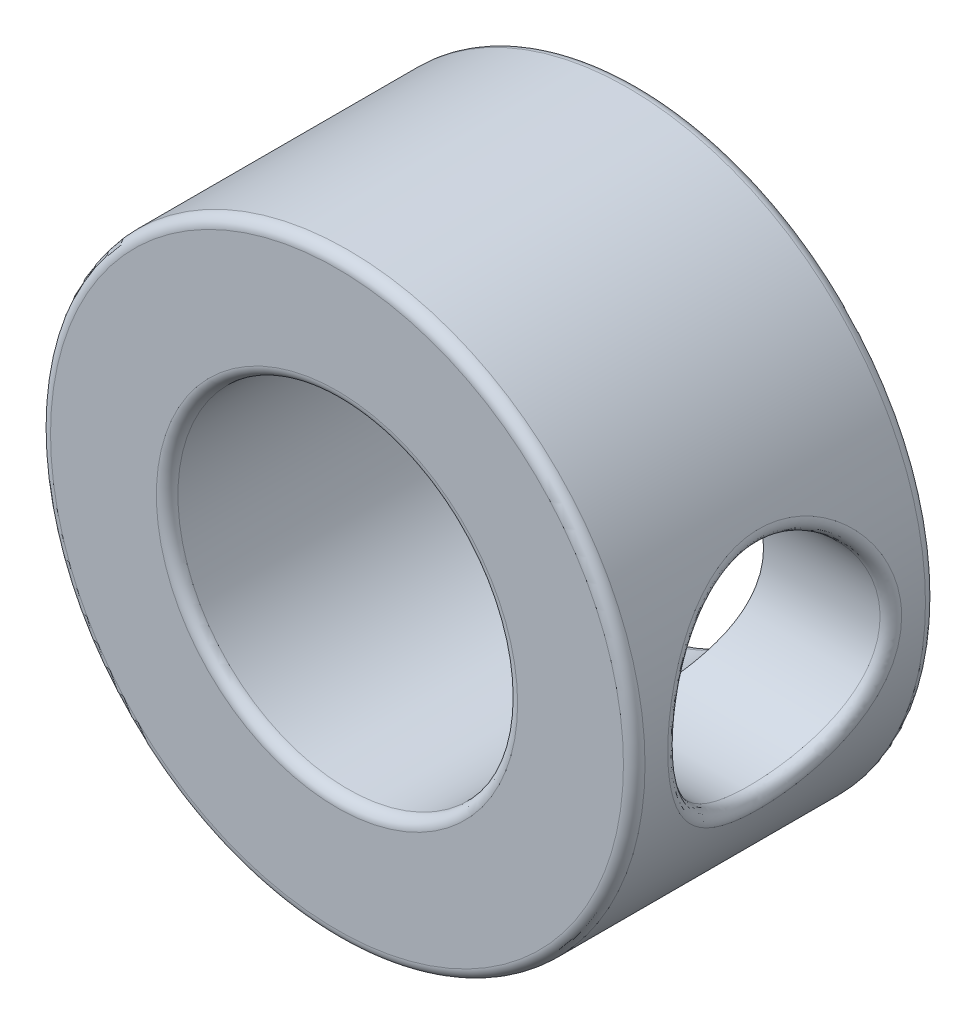
ISO-10303-21;
HEADER;
FILE_DESCRIPTION(('STEP AP214'),'2;1');
FILE_NAME('part.step','',(''),(''),'','','');
FILE_SCHEMA(('AUTOMOTIVE_DESIGN { 1 0 10303 214 1 1 1 1 }'));
ENDSEC;
DATA;
#1=APPLICATION_CONTEXT('core data for automotive mechanical design processes');
#2=APPLICATION_PROTOCOL_DEFINITION('international standard','automotive_design',2000,#1);
#3=PRODUCT_CONTEXT('',#1,'mechanical');
#4=PRODUCT('Part','Part','',(#3));
#5=PRODUCT_RELATED_PRODUCT_CATEGORY('part','',(#4));
#6=PRODUCT_DEFINITION_FORMATION('','',#4);
#7=PRODUCT_DEFINITION_CONTEXT('part definition',#1,'design');
#8=PRODUCT_DEFINITION('design','',#6,#7);
#9=PRODUCT_DEFINITION_SHAPE('','',#8);
#10=(LENGTH_UNIT() NAMED_UNIT(*) SI_UNIT(.MILLI.,.METRE.));
#11=(NAMED_UNIT(*) PLANE_ANGLE_UNIT() SI_UNIT($,.RADIAN.));
#12=(NAMED_UNIT(*) SI_UNIT($,.STERADIAN.) SOLID_ANGLE_UNIT());
#13=UNCERTAINTY_MEASURE_WITH_UNIT(LENGTH_MEASURE(1.E-05),#10,'distance_accuracy_value','');
#14=(GEOMETRIC_REPRESENTATION_CONTEXT(3) GLOBAL_UNCERTAINTY_ASSIGNED_CONTEXT((#13)) GLOBAL_UNIT_ASSIGNED_CONTEXT((#10,
#11,#12)) REPRESENTATION_CONTEXT('',''));
#15=CARTESIAN_POINT('',(0.,0.,0.));
#16=DIRECTION('',(0.,0.,1.));
#17=DIRECTION('',(1.,0.,0.));
#18=AXIS2_PLACEMENT_3D('',#15,#16,#17);
#19=CARTESIAN_POINT('',(0.,0.,7.112));
#20=DIRECTION('',(0.,0.,-1.));
#21=DIRECTION('',(-1.,0.,0.));
#22=AXIS2_PLACEMENT_3D('',#19,#20,#21);
#23=CYLINDRICAL_SURFACE('',#22,7.);
#24=CARTESIAN_POINT('',(0.,0.,0.254));
#25=DIRECTION('',(0.,0.,1.));
#26=DIRECTION('',(1.,0.,0.));
#27=AXIS2_PLACEMENT_3D('',#24,#25,#26);
#28=CIRCLE('',#27,7.);
#29=CARTESIAN_POINT('',(7.,0.,0.254));
#30=VERTEX_POINT('',#29);
#31=EDGE_CURVE('E56',#30,#30,#28,.T.);
#32=ORIENTED_EDGE('',*,*,#31,.T.);
#33=EDGE_LOOP('',(#32));
#34=FACE_BOUND('',#33,.T.);
#35=CARTESIAN_POINT('',(6.74599500718926,-0.00745052215797418,6.06868889791926));
#36=CARTESIAN_POINT('',(6.99999574017128,-0.00775954866647524,6.06868797695163));
#37=CARTESIAN_POINT('',(6.99999481920024,-0.00851652334191676,6.32268776994786));
#38=CARTESIAN_POINT('',(6.74617475965916,0.124835560306429,6.069086080199));
#39=CARTESIAN_POINT('',(7.00015029724777,0.129996556773914,6.06912106931478));
#40=CARTESIAN_POINT('',(7.00018133971602,0.142696705103797,6.32312530594202));
#41=CARTESIAN_POINT('',(6.74158726574779,0.257138681927097,6.05894237310063));
#42=CARTESIAN_POINT('',(6.99620204408758,0.26826355056612,6.05805022996153));
#43=CARTESIAN_POINT('',(6.99542111770413,0.293929410623252,6.31195099821696));
#44=CARTESIAN_POINT('',(6.7233669678945,0.517967373589116,6.01801333593985));
#45=CARTESIAN_POINT('',(6.98070531949423,0.539434271171296,6.01378552701942));
#46=CARTESIAN_POINT('',(6.97651479025564,0.592076787908436,6.2668635708834));
#47=CARTESIAN_POINT('',(6.70973425810543,0.646492982936553,5.98722822073657));
#48=CARTESIAN_POINT('',(6.96905385022817,0.673211427196951,5.98029468301626));
#49=CARTESIAN_POINT('',(6.96236878251692,0.738991504604062,6.23295068796371));
#50=CARTESIAN_POINT('',(6.67488718386159,0.895641381954533,5.90641209807691));
#51=CARTESIAN_POINT('',(6.93969470419769,0.930822766268684,5.89325263934802));
#52=CARTESIAN_POINT('',(6.92620964822275,1.02378740357091,6.14392364724122));
#53=CARTESIAN_POINT('',(6.6537131560639,1.01630225225893,5.85648337834778));
#54=CARTESIAN_POINT('',(6.92185086834899,1.05535653793761,5.83928123973794));
#55=CARTESIAN_POINT('',(6.90423837707852,1.16171211495338,6.08892216959862));
#56=CARTESIAN_POINT('',(6.60577141401848,1.24769505750066,5.7389785534838));
#57=CARTESIAN_POINT('',(6.8821123944386,1.29232382007279,5.713633277951));
#58=CARTESIAN_POINT('',(6.85449153548767,1.42621199637491,5.95947885452916));
#59=CARTESIAN_POINT('',(6.57900217147332,1.35842426783403,5.6713976254984));
#60=CARTESIAN_POINT('',(6.86004484818301,1.40508746039763,5.6413153254743));
#61=CARTESIAN_POINT('',(6.82671437920034,1.55278405198084,5.88503170425012));
#62=CARTESIAN_POINT('',(6.52052151386465,1.57419410821126,5.51567068467706));
#63=CARTESIAN_POINT('',(6.81271802853817,1.62297606677249,5.476552103599));
#64=CARTESIAN_POINT('',(6.76603181072791,1.79942567546163,5.71348290623909));
#65=CARTESIAN_POINT('',(6.48860661428057,1.6784567525599,5.42650963693316));
#66=CARTESIAN_POINT('',(6.78724794589171,1.72702348546625,5.38254612816564));
#67=CARTESIAN_POINT('',(6.73291525237285,1.91860594546923,5.61526309605367));
#68=CARTESIAN_POINT('',(6.42438105147322,1.87100880090019,5.23243750721342));
#69=CARTESIAN_POINT('',(6.73717148199862,1.91705862237536,5.18089226940311));
#70=CARTESIAN_POINT('',(6.66627147241469,2.13870783624837,5.4014732379559));
#71=CARTESIAN_POINT('',(6.3920703140393,1.9592951592129,5.12752342908013));
#72=CARTESIAN_POINT('',(6.71256140693235,2.00262984024887,5.07273090275755));
#73=CARTESIAN_POINT('',(6.63274417380709,2.2396259755733,5.2858998894765));
#74=CARTESIAN_POINT('',(6.32889383780691,2.12175246984529,4.89866432164761));
#75=CARTESIAN_POINT('',(6.66560179013371,2.15834311294188,4.84036130261562));
#76=CARTESIAN_POINT('',(6.5671889811011,2.42532725259425,5.03378869672509));
#77=CARTESIAN_POINT('',(6.29817738047511,2.19501535861611,4.77403697608756));
#78=CARTESIAN_POINT('',(6.6436241820243,2.22658491299537,4.71570407447646));
#79=CARTESIAN_POINT('',(6.53531598914885,2.50907240337135,4.89649921286074));
#80=CARTESIAN_POINT('',(6.2438892298088,2.31931829921106,4.51296569556758));
#81=CARTESIAN_POINT('',(6.60569009337165,2.34119243601201,4.45884049347737));
#82=CARTESIAN_POINT('',(6.47898378401825,2.65116028288201,4.60890309024146));
#83=CARTESIAN_POINT('',(6.22031435749867,2.37036824324256,4.37652705311809));
#84=CARTESIAN_POINT('',(6.59002470400532,2.38657655555385,4.32726570160749));
#85=CARTESIAN_POINT('',(6.45452127216944,2.70951431917396,4.45860228171603));
#86=CARTESIAN_POINT('',(6.18443493529895,2.44648664924731,4.10174894600231));
#87=CARTESIAN_POINT('',(6.56646971684204,2.45406174138135,4.06538176126362));
#88=CARTESIAN_POINT('',(6.41729092017634,2.79652354725973,4.15590671891505));
#89=CARTESIAN_POINT('',(6.17169113025569,2.47257376857739,3.96374087413946));
#90=CARTESIAN_POINT('',(6.55851674389204,2.47636832404332,3.9363969955974));
#91=CARTESIAN_POINT('',(6.40406728607884,2.82634314323857,4.0038770269516));
#92=CARTESIAN_POINT('',(6.15766919079355,2.5012249014656,3.6848604724077));
#93=CARTESIAN_POINT('',(6.5496757407383,2.50114510337192,3.67598562081094));
#94=CARTESIAN_POINT('',(6.38951739333781,2.85909360512128,3.69666237640475));
#95=CARTESIAN_POINT('',(6.1563846674149,2.50380202270742,3.54398978246969));
#96=CARTESIAN_POINT('',(6.54889557520336,2.50331274178223,3.54620429092653));
#97=CARTESIAN_POINT('',(6.38818450517773,2.86203945412186,3.54147922436922));
#98=CARTESIAN_POINT('',(6.16510701715563,2.48603940149925,3.27467873157116));
#99=CARTESIAN_POINT('',(6.55437545682559,2.4879827951206,3.29526601767755));
#100=CARTESIAN_POINT('',(6.39723526831701,2.84173540362241,3.24480617069823));
#101=CARTESIAN_POINT('',(6.17427435775616,2.46740373106779,3.14609841771757));
#102=CARTESIAN_POINT('',(6.56005214291856,2.47211489630638,3.17562681110344));
#103=CARTESIAN_POINT('',(6.40674777707107,2.82043339030019,3.10316209695588));
#104=CARTESIAN_POINT('',(6.20138388661499,2.41072452564713,2.8940938933087));
#105=CARTESIAN_POINT('',(6.57758779358048,2.42231648838049,2.93717425331876));
#106=CARTESIAN_POINT('',(6.4348780323861,2.7556446727268,2.82555391287066));
#107=CARTESIAN_POINT('',(6.21932756401245,2.37267769699095,2.7706705616317));
#108=CARTESIAN_POINT('',(6.58927755524305,2.38887375002368,2.81944325121164));
#109=CARTESIAN_POINT('',(6.45349732415524,2.71215420355941,2.6895907707001));
#110=CARTESIAN_POINT('',(6.26222721557043,2.27780631864489,2.53015585140741));
#111=CARTESIAN_POINT('',(6.61849346437203,2.30280266485545,2.58586321498023));
#112=CARTESIAN_POINT('',(6.49801223070246,2.60370887698734,2.42463976590368));
#113=CARTESIAN_POINT('',(6.28728604764049,2.22070400242742,2.41318988469384));
#114=CARTESIAN_POINT('',(6.63589033998288,2.2505692345565,2.47070455336523));
#115=CARTESIAN_POINT('',(6.52401457618485,2.5384365109469,2.29579005695349));
#116=CARTESIAN_POINT('',(6.3416584943086,2.08942097198359,2.18988124504264));
#117=CARTESIAN_POINT('',(6.67510159084638,2.12712238612379,2.24745346481761));
#118=CARTESIAN_POINT('',(6.58043425106791,2.38836984857238,2.04979325952076));
#119=CARTESIAN_POINT('',(6.37098094615926,2.01520459333029,2.08356143091079));
#120=CARTESIAN_POINT('',(6.69674839069637,2.05655739596535,2.13954752885772));
#121=CARTESIAN_POINT('',(6.61086075046211,2.30353478503895,1.93267135229876));
#122=CARTESIAN_POINT('',(6.43343248507526,1.84480777933649,1.87572390122297));
#123=CARTESIAN_POINT('',(6.74411824857742,1.89129221498729,1.92659635916525));
#124=CARTESIAN_POINT('',(6.67566371124585,2.10875804154355,1.70371752957919));
#125=CARTESIAN_POINT('',(6.46667759999969,1.74733598177556,1.77529096529201));
#126=CARTESIAN_POINT('',(6.76999902360233,1.79552742443319,1.82194126110804));
#127=CARTESIAN_POINT('',(6.71016056913222,1.99734023463259,1.59308060731098));
#128=CARTESIAN_POINT('',(6.53119380168288,1.5369123966416,1.59200125948189));
#129=CARTESIAN_POINT('',(6.82119569283943,1.58560318589575,1.62987378884546));
#130=CARTESIAN_POINT('',(6.77710593103787,1.75680979440163,1.39116866739033));
#131=CARTESIAN_POINT('',(6.56246818627252,1.42398753028151,1.50911454779781));
#132=CARTESIAN_POINT('',(6.84658402540374,1.47173299218538,1.54176154519891));
#133=CARTESIAN_POINT('',(6.80955785705728,1.62772793411116,1.29986066584544));
#134=CARTESIAN_POINT('',(6.62061378231264,1.18187120582218,1.36102484885744));
#135=CARTESIAN_POINT('',(6.89421869795565,1.22552774355322,1.38427660666702));
#136=CARTESIAN_POINT('',(6.86989274776059,1.3509702404875,1.13672505351021));
#137=CARTESIAN_POINT('',(6.64734657230553,1.05232836656872,1.29634786762083));
#138=CARTESIAN_POINT('',(6.91658186261675,1.09248736959098,1.31454210362623));
#139=CARTESIAN_POINT('',(6.89763207914547,1.20289275130575,1.06547689094913));
#140=CARTESIAN_POINT('',(6.69231708566452,0.78294869085631,1.1900567413545));
#141=CARTESIAN_POINT('',(6.95425779013848,0.814861539100033,1.20034168784231));
#142=CARTESIAN_POINT('',(6.94429581963911,0.894970937587026,0.948386586245924));
#143=CARTESIAN_POINT('',(6.71055665821608,0.643114102853319,1.14843757568783));
#144=CARTESIAN_POINT('',(6.96981502511989,0.669556426716317,1.15506834092958));
#145=CARTESIAN_POINT('',(6.96322214755874,0.735129183209213,0.902538913370125));
#146=CARTESIAN_POINT('',(6.73680606806903,0.352345868297734,1.08905573446135));
#147=CARTESIAN_POINT('',(6.99208697329174,0.367666693145553,1.09092310610918));
#148=CARTESIAN_POINT('',(6.99045989869069,0.402758591700327,0.837123877090485));
#149=CARTESIAN_POINT('',(6.74442405090057,0.201193886132936,1.07220570423221));
#150=CARTESIAN_POINT('',(6.99865558212128,0.209596007369462,1.07249670636575));
#151=CARTESIAN_POINT('',(6.99836471334925,0.229980180070058,0.81856188378181));
#152=CARTESIAN_POINT('',(6.7471311492059,-0.101743128314702,1.06618343862989));
#153=CARTESIAN_POINT('',(7.00096379231302,-0.105866177890564,1.06597768407563));
#154=CARTESIAN_POINT('',(7.00117373916869,-0.116300268464983,0.811927755992532));
#155=CARTESIAN_POINT('',(6.74222234658202,-0.253528051219516,1.0770066040813));
#156=CARTESIAN_POINT('',(6.99672634589457,-0.264692295457886,1.07782052618199));
#157=CARTESIAN_POINT('',(6.99608011061958,-0.289802180342207,0.823850555060279));
#158=CARTESIAN_POINT('',(6.72149200392215,-0.53922249566664,1.12362265272209));
#159=CARTESIAN_POINT('',(6.97911064771732,-0.561575132057807,1.12820055613337));
#160=CARTESIAN_POINT('',(6.97456923025548,-0.616373037142319,0.875202794234697));
#161=CARTESIAN_POINT('',(6.70663076400289,-0.673556627158349,1.15722118557895));
#162=CARTESIAN_POINT('',(6.96640519535537,-0.701387976153548,1.16477221645581));
#163=CARTESIAN_POINT('',(6.9591484357296,-0.76992734409442,0.912214938016811));
#164=CARTESIAN_POINT('',(6.66864848829413,-0.933983964250526,1.24564470355815));
#165=CARTESIAN_POINT('',(6.93443904336934,-0.970491739416666,1.25996635860784));
#166=CARTESIAN_POINT('',(6.91973605371112,-1.0676159420748,1.00962228542852));
#167=CARTESIAN_POINT('',(6.64552756344272,-1.06007728050873,1.30046940358686));
#168=CARTESIAN_POINT('',(6.91497959072871,-1.10050364819274,1.31921737695957));
#169=CARTESIAN_POINT('',(6.89574458133365,-1.21175035959344,1.07001717499898));
#170=CARTESIAN_POINT('',(6.59350313896387,-1.30049787456635,1.42924582951773));
#171=CARTESIAN_POINT('',(6.8719867473983,-1.34628102718631,1.45672813385501));
#172=CARTESIAN_POINT('',(6.84176133578025,-1.48656970204544,1.21187728578905));
#173=CARTESIAN_POINT('',(6.56461537128212,-1.41485590844356,1.50314567572079));
#174=CARTESIAN_POINT('',(6.84826886049391,-1.46242406439471,1.53568582522136));
#175=CARTESIAN_POINT('',(6.81178588689061,-1.6172897835561,1.29328535633229));
#176=CARTESIAN_POINT('',(6.50386917324341,-1.62973329234693,1.66808783703664));
#177=CARTESIAN_POINT('',(6.79942101374447,-1.6785170052823,1.70961253538459));
#178=CARTESIAN_POINT('',(6.74875247654279,-1.86291126039933,1.47498564123637));
#179=CARTESIAN_POINT('',(6.4720098205443,-1.7302483215453,1.75913548360581));
#180=CARTESIAN_POINT('',(6.77417751903423,-1.77838180339077,1.80527329684683));
#181=CARTESIAN_POINT('',(6.7156935580149,-1.9778077166915,1.57528372872957));
#182=CARTESIAN_POINT('',(6.40692714327061,-1.91974259715151,1.96101300280086));
#183=CARTESIAN_POINT('',(6.72377491772203,-1.96467323656207,2.01442375905859));
#184=CARTESIAN_POINT('',(6.64816039199597,-2.19441433671334,1.79767200389653));
#185=CARTESIAN_POINT('',(6.37371152519006,-2.00793938026583,2.07258116524781));
#186=CARTESIAN_POINT('',(6.6987367491815,-2.04958140693839,2.12889553933528));
#187=CARTESIAN_POINT('',(6.61369414111891,-2.29523008434207,1.92057549163502));
#188=CARTESIAN_POINT('',(6.31121658717996,-2.16451428897615,2.30970896802177));
#189=CARTESIAN_POINT('',(6.65283299890492,-2.19851011844833,2.36814805169349));
#190=CARTESIAN_POINT('',(6.54884614719724,-2.47420732060731,2.1817954791641));
#191=CARTESIAN_POINT('',(6.28193735665949,-2.23289196445184,2.43526892603284));
#192=CARTESIAN_POINT('',(6.63216244418459,-2.26167206869169,2.49289730402178));
#193=CARTESIAN_POINT('',(6.51846449692815,-2.55236829472148,2.32011232891544));
#194=CARTESIAN_POINT('',(6.23103619756914,-2.34748784712025,2.69710716043137));
#195=CARTESIAN_POINT('',(6.59701541304028,-2.36654554498145,2.74897710174495));
#196=CARTESIAN_POINT('',(6.46564681045398,-2.68336025597442,2.60855332793352));
#197=CARTESIAN_POINT('',(6.20940070286188,-2.39374536539925,2.83336591765194));
#198=CARTESIAN_POINT('',(6.5828180663572,-2.40735043507475,2.87955884061482));
#199=CARTESIAN_POINT('',(6.44319669732043,-2.73623617872677,2.75865597488601));
#200=CARTESIAN_POINT('',(6.1768066694294,-2.46226954609273,3.11276617212144));
#201=CARTESIAN_POINT('',(6.56160267223961,-2.46779103397403,3.14470547543043));
#202=CARTESIAN_POINT('',(6.40937543520834,-2.81456461959772,3.06644329520835));
#203=CARTESIAN_POINT('',(6.16583982164306,-2.48455488019382,3.25590222180086));
#204=CARTESIAN_POINT('',(6.55482817048821,-2.48672064125955,3.27783148129184));
#205=CARTESIAN_POINT('',(6.39799566431638,-2.84003848089893,3.22412196753563));
#206=CARTESIAN_POINT('',(6.15663635534922,-2.50328258444837,3.5327779031588));
#207=CARTESIAN_POINT('',(6.54905896639293,-2.50285159529922,3.535753004738));
#208=CARTESIAN_POINT('',(6.38844566965103,-2.86144569599824,3.52912821811991));
#209=CARTESIAN_POINT('',(6.15746179938372,-2.50162887348298,3.66636570562676));
#210=CARTESIAN_POINT('',(6.54955888583049,-2.50146426084053,3.65892197782527));
#211=CARTESIAN_POINT('',(6.38930219325396,-2.85955537640145,3.6762885413186));
#212=CARTESIAN_POINT('',(6.16945790611404,-2.47715225419983,3.93118479457717));
#213=CARTESIAN_POINT('',(6.5571074672935,-2.48032598070458,3.90600881020323));
#214=CARTESIAN_POINT('',(6.40174997669628,-2.83157670657923,3.96801324970605));
#215=CARTESIAN_POINT('',(6.18062823859916,-2.45433002158506,4.06241615614133));
#216=CARTESIAN_POINT('',(6.56406950851866,-2.46081776662134,4.02851247143701));
#217=CARTESIAN_POINT('',(6.41334089389188,-2.80548912873459,4.11257771760484));
#218=CARTESIAN_POINT('',(6.21137841092189,-2.38947751065387,4.31496078092069));
#219=CARTESIAN_POINT('',(6.58414742144651,-2.40349713731045,4.26862120022654));
#220=CARTESIAN_POINT('',(6.4452488699159,-2.73135769050654,4.39078087626267));
#221=CARTESIAN_POINT('',(6.2307007608724,-2.34803302455308,4.43645234904647));
#222=CARTESIAN_POINT('',(6.59688609589204,-2.36679419998635,4.38519557650292));
#223=CARTESIAN_POINT('',(6.46529874386299,-2.6839834359537,4.52461598771117));
#224=CARTESIAN_POINT('',(6.27554991297361,-2.24745226491674,4.67110374980427));
#225=CARTESIAN_POINT('',(6.62776093829919,-2.27492139765518,4.61435482684815));
#226=CARTESIAN_POINT('',(6.5118365536351,-2.56901184482894,4.78310797078281));
#227=CARTESIAN_POINT('',(6.30108898053316,-2.18828096295734,4.78424652825997));
#228=CARTESIAN_POINT('',(6.64570007161638,-2.22038737791661,4.72638431115498));
#229=CARTESIAN_POINT('',(6.53833721668543,-2.50137446805811,4.90774605552531));
#230=CARTESIAN_POINT('',(6.35762855721794,-2.04926344375663,5.0070736413772));
#231=CARTESIAN_POINT('',(6.68682545138395,-2.08901119409412,4.95001511841377));
#232=CARTESIAN_POINT('',(6.59700561821759,-2.34246668656022,5.1532124033474));
#233=CARTESIAN_POINT('',(6.38888259239739,-1.9682834102046,5.11599734301435));
#234=CARTESIAN_POINT('',(6.71014375239216,-2.01152451430658,5.06117181093381));
#235=CARTESIAN_POINT('',(6.62943642850087,-2.24990024205756,5.27320275308874));
#236=CARTESIAN_POINT('',(6.45217328051481,-1.79007817288132,5.31908642371696));
#237=CARTESIAN_POINT('',(6.75867197661743,-1.8374510541862,5.27048419475433));
#238=CARTESIAN_POINT('',(6.69511013393472,-2.04619786641972,5.49692568438741));
#239=CARTESIAN_POINT('',(6.4842087623385,-1.69287613958493,5.41327248650574));
#240=CARTESIAN_POINT('',(6.7838269353289,-1.74141835179989,5.36901608999538));
#241=CARTESIAN_POINT('',(6.72835181387624,-1.93508842093028,5.60068105113438));
#242=CARTESIAN_POINT('',(6.54785199296266,-1.47776581444595,5.59027502566655));
#243=CARTESIAN_POINT('',(6.83460842553514,-1.52617141591351,5.55489892049378));
#244=CARTESIAN_POINT('',(6.79439133570955,-1.68920067422554,5.79566704827463));
#245=CARTESIAN_POINT('',(6.57931360706344,-1.35895442379789,5.67204307062303));
#246=CARTESIAN_POINT('',(6.86031405466314,-1.40590590508352,5.64210310761396));
#247=CARTESIAN_POINT('',(6.82703754064347,-1.5533900611962,5.88574272662324));
#248=CARTESIAN_POINT('',(6.6361333136035,-1.10811578825779,5.81432974791032));
#249=CARTESIAN_POINT('',(6.90710778583842,-1.14999421800565,5.79380532775294));
#250=CARTESIAN_POINT('',(6.88599661948688,-1.26666209108769,6.04248573032136));
#251=CARTESIAN_POINT('',(6.66149291659634,-0.976091825621541,5.87485364093888));
#252=CARTESIAN_POINT('',(6.92841931263388,-1.01402874960498,5.85919954015159));
#253=CARTESIAN_POINT('',(6.9123110608252,-1.11574848588087,6.10915885085552));
#254=CARTESIAN_POINT('',(6.70253869486604,-0.706775368563131,5.97083471383174));
#255=CARTESIAN_POINT('',(6.96292550323798,-0.735886356519368,5.96249434670756));
#256=CARTESIAN_POINT('',(6.95490229230872,-0.807898935968735,6.2148916007597));
#257=CARTESIAN_POINT('',(6.71850364056666,-0.569778523954664,6.00701938895248));
#258=CARTESIAN_POINT('',(6.97656677287585,-0.59335368098076,6.00187657909497));
#259=CARTESIAN_POINT('',(6.9714683491298,-0.651300941877383,6.25475263890242));
#260=CARTESIAN_POINT('',(6.74013288507272,-0.291009533796057,6.05572769957978));
#261=CARTESIAN_POINT('',(6.99494714870204,-0.303652523502294,6.054532741536));
#262=CARTESIAN_POINT('',(6.9939119766954,-0.332646415209117,6.3084097138909));
#263=CARTESIAN_POINT('',(6.74580234160249,-0.149239815587015,6.06826318272869));
#264=CARTESIAN_POINT('',(6.99983005760977,-0.155431754495124,6.06822370929258));
#265=CARTESIAN_POINT('',(6.99979489936249,-0.170592657270906,6.3222188020995));
#266=CARTESIAN_POINT('',(6.74599500718926,-0.00745052215797418,6.06868889791926));
#267=CARTESIAN_POINT('',(6.99999574017128,-0.00775954866647524,6.06868797695163));
#268=CARTESIAN_POINT('',(6.99999481920024,-0.00851652334191676,6.32268776994786));
#269=(BOUNDED_SURFACE() B_SPLINE_SURFACE(3,2,((#35,#36,#37),(#38,#39,#40),(#41,#42,#43),(#44,
#45,#46),(#47,#48,#49),(#50,#51,#52),(#53,#54,#55),(#56,#57,#58),(#59,#60,#61),(#62,#63,#64),
(#65,#66,#67),(#68,#69,#70),(#71,#72,#73),(#74,#75,#76),(#77,#78,#79),(#80,#81,#82),(#83,#84,
#85),(#86,#87,#88),(#89,#90,#91),(#92,#93,#94),(#95,#96,#97),(#98,#99,#100),(#101,#102,#103),
(#104,#105,#106),(#107,#108,#109),(#110,#111,#112),(#113,#114,#115),(#116,#117,#118),(#119,#120,
#121),(#122,#123,#124),(#125,#126,#127),(#128,#129,#130),(#131,#132,#133),(#134,#135,#136),
(#137,#138,#139),(#140,#141,#142),(#143,#144,#145),(#146,#147,#148),(#149,#150,#151),(#152,#153,
#154),(#155,#156,#157),(#158,#159,#160),(#161,#162,#163),(#164,#165,#166),(#167,#168,#169),
(#170,#171,#172),(#173,#174,#175),(#176,#177,#178),(#179,#180,#181),(#182,#183,#184),(#185,#186,
#187),(#188,#189,#190),(#191,#192,#193),(#194,#195,#196),(#197,#198,#199),(#200,#201,#202),
(#203,#204,#205),(#206,#207,#208),(#209,#210,#211),(#212,#213,#214),(#215,#216,#217),(#218,#219,
#220),(#221,#222,#223),(#224,#225,#226),(#227,#228,#229),(#230,#231,#232),(#233,#234,#235),
(#236,#237,#238),(#239,#240,#241),(#242,#243,#244),(#245,#246,#247),(#248,#249,#250),(#251,#252,
#253),(#254,#255,#256),(#257,#258,#259),(#260,#261,#262),(#263,#264,#265),(#266,#267,#268)),
.UNSPECIFIED.,.T.,.F.,.F.) B_SPLINE_SURFACE_WITH_KNOTS((4,2,2,2,2,2,2,2,2,2,2,2,2,2,2,2,2,2,2,2,
2,2,2,2,2,2,2,2,2,2,2,2,2,2,2,2,2,2,4),(3,3),(0.,0.436616816613531,0.873229088495827,
1.30754026014324,1.7419702165227,2.20332701356622,2.66477167006437,3.14891689599693,
3.63284629377312,4.09605981286772,4.55901505769138,4.98725269585577,5.41556302115605,
5.8504112676483,6.28617402833659,6.75719884491079,7.22741328229283,7.71007093731095,
8.1926234565156,8.69254558865021,9.19238464110891,9.64985433978013,10.1073178942816,
10.5635501350001,11.0199244586506,11.4981435117212,11.9763734249801,12.4537502586139,
12.9307549985313,13.370046284713,13.809323549121,14.235657226788,14.6628389652816,
15.1191208558483,15.5747565143188,16.0582739803792,16.5416716282068,17.0098888941128,
17.4778715327515),(0.,1.),
.UNSPECIFIED.) GEOMETRIC_REPRESENTATION_ITEM() RATIONAL_B_SPLINE_SURFACE(((1.,0.707105499250372,
1.),(1.,0.707151568524417,1.),(1.,0.705975624706469,1.),(1.,0.701283628800488,1.),(1.,
0.697767601070697,1.),(1.,0.688713643274153,1.),(1.,0.683186467007165,1.),(1.,0.670548543798973,
1.),(1.,0.663437364162354,1.),(1.,0.6477159237772,1.),(1.,0.639040066483442,1.),(1.,
0.621330678263549,1.),(1.,0.612297079537722,1.),(1.,0.594376362277532,1.),(1.,0.585518312032593,
1.),(1.,0.569656230766806,1.),(1.,0.56265137499905,1.),(1.,0.551904458816385,1.),(1.,
0.54803556217127,1.),(1.,0.543775282376949,1.),(1.,0.543381961471004,1.),(1.,0.54603566906861,
1.),(1.,0.548826913280007,1.),(1.,0.556991155308121,1.),(1.,0.562364591259699,1.),(1.,
0.575034238672183,1.),(1.,0.582358548213234,1.),(1.,0.598014865389343,1.),(1.,0.606348959884586,
1.),(1.,0.623849143616808,1.),(1.,0.633027985672754,1.),(1.,0.650610135145573,1.),(1.,
0.6590147496693,1.),(1.,0.674487031609283,1.),(1.,0.681513433977585,1.),(1.,0.693257600540166,
1.),(1.,0.697975867284514,1.),(1.,0.704749100232979,1.),(1.,0.706702086918782,1.),(1.,
0.707397267552474,1.),(1.,0.706139995032764,1.),(1.,0.700799992274449,1.),(1.,0.696965798613078,
1.),(1.,0.687086993309696,1.),(1.,0.68104241135599,1.),(1.,0.667294265049192,1.),(1.,
0.659595209822415,1.),(1.,0.643195393795966,1.),(1.,0.63449432178507,1.),(1.,0.616464802533296,
1.),(1.,0.607126260807396,1.),(1.,0.58929391622825,1.),(1.,0.580800132563545,1.),(1.,
0.565851819804034,1.),(1.,0.559393680058602,1.),(1.,0.549598506195007,1.),(1.,0.546259043239385,
1.),(1.,0.543458175179166,1.),(1.,0.543711033832741,1.),(1.,0.54735789146473,1.),(1.,
0.550751790180577,1.),(1.,0.559982646139575,1.),(1.,0.565744670429481,1.),(1.,0.578931670391599,
1.),(1.,0.586359931198677,1.),(1.,0.602565616565709,1.),(1.,0.61140047696624,1.),(1.,
0.629033893142096,1.),(1.,0.637832482613767,1.),(1.,0.655101396334361,1.),(1.,0.663518685706596,
1.),(1.,0.678577045884776,1.),(1.,0.685218556330365,1.),(1.,0.695907063458064,1.),(1.,
0.700028987247134,1.),(1.,0.705602847278354,1.),(1.,0.707056120436714,1.),(1.,0.707105499250372,1.))) REPRESENTATION_ITEM('') SURFACE());
#270=CARTESIAN_POINT('',(6.99999481920024,-0.00851652334191676,6.32268776994786));
#271=CARTESIAN_POINT('',(7.00018133971602,0.142696705103797,6.32312530594202));
#272=CARTESIAN_POINT('',(6.99542111770413,0.293929410623252,6.31195099821696));
#273=CARTESIAN_POINT('',(6.97651479025564,0.592076787908436,6.2668635708834));
#274=CARTESIAN_POINT('',(6.96236878251692,0.738991504604062,6.23295068796371));
#275=CARTESIAN_POINT('',(6.92620964822275,1.02378740357091,6.14392364724122));
#276=CARTESIAN_POINT('',(6.90423837707852,1.16171211495338,6.08892216959862));
#277=CARTESIAN_POINT('',(6.85449153548767,1.42621199637491,5.95947885452916));
#278=CARTESIAN_POINT('',(6.82671437920034,1.55278405198084,5.88503170425012));
#279=CARTESIAN_POINT('',(6.76603181072791,1.79942567546163,5.71348290623909));
#280=CARTESIAN_POINT('',(6.73291525237285,1.91860594546923,5.61526309605367));
#281=CARTESIAN_POINT('',(6.6662714724147,2.13870783624837,5.4014732379559));
#282=CARTESIAN_POINT('',(6.63274417380709,2.2396259755733,5.2858998894765));
#283=CARTESIAN_POINT('',(6.5671889811011,2.42532725259425,5.03378869672509));
#284=CARTESIAN_POINT('',(6.53531598914885,2.50907240337135,4.89649921286074));
#285=CARTESIAN_POINT('',(6.47898378401825,2.65116028288201,4.60890309024146));
#286=CARTESIAN_POINT('',(6.45452127216944,2.70951431917396,4.45860228171603));
#287=CARTESIAN_POINT('',(6.41729092017634,2.79652354725973,4.15590671891505));
#288=CARTESIAN_POINT('',(6.40406728607884,2.82634314323857,4.0038770269516));
#289=CARTESIAN_POINT('',(6.38951739333781,2.85909360512128,3.69666237640475));
#290=CARTESIAN_POINT('',(6.38818450517773,2.86203945412186,3.54147922436922));
#291=CARTESIAN_POINT('',(6.39723526831701,2.84173540362241,3.24480617069823));
#292=CARTESIAN_POINT('',(6.40674777707107,2.82043339030019,3.10316209695588));
#293=CARTESIAN_POINT('',(6.4348780323861,2.7556446727268,2.82555391287066));
#294=CARTESIAN_POINT('',(6.45349732415524,2.71215420355941,2.6895907707001));
#295=CARTESIAN_POINT('',(6.49801223070246,2.60370887698734,2.42463976590368));
#296=CARTESIAN_POINT('',(6.52401457618485,2.5384365109469,2.29579005695349));
#297=CARTESIAN_POINT('',(6.58043425106791,2.38836984857238,2.04979325952076));
#298=CARTESIAN_POINT('',(6.61086075046211,2.30353478503895,1.93267135229876));
#299=CARTESIAN_POINT('',(6.67566371124585,2.10875804154355,1.70371752957919));
#300=CARTESIAN_POINT('',(6.71016056913222,1.99734023463259,1.59308060731098));
#301=CARTESIAN_POINT('',(6.77710593103788,1.75680979440163,1.39116866739033));
#302=CARTESIAN_POINT('',(6.80955785705728,1.62772793411116,1.29986066584544));
#303=CARTESIAN_POINT('',(6.86989274776059,1.3509702404875,1.13672505351021));
#304=CARTESIAN_POINT('',(6.89763207914547,1.20289275130575,1.06547689094913));
#305=CARTESIAN_POINT('',(6.94429581963911,0.894970937587026,0.948386586245924));
#306=CARTESIAN_POINT('',(6.96322214755874,0.735129183209213,0.902538913370125));
#307=CARTESIAN_POINT('',(6.99045989869069,0.402758591700327,0.837123877090486));
#308=CARTESIAN_POINT('',(6.99836471334925,0.229980180070058,0.81856188378181));
#309=CARTESIAN_POINT('',(7.00117373916869,-0.116300268464983,0.811927755992532));
#310=CARTESIAN_POINT('',(6.99608011061958,-0.289802180342207,0.823850555060279));
#311=CARTESIAN_POINT('',(6.97456923025548,-0.616373037142319,0.875202794234697));
#312=CARTESIAN_POINT('',(6.9591484357296,-0.76992734409442,0.912214938016811));
#313=CARTESIAN_POINT('',(6.91973605371112,-1.0676159420748,1.00962228542852));
#314=CARTESIAN_POINT('',(6.89574458133365,-1.21175035959344,1.07001717499898));
#315=CARTESIAN_POINT('',(6.84176133578025,-1.48656970204544,1.21187728578905));
#316=CARTESIAN_POINT('',(6.81178588689061,-1.6172897835561,1.29328535633229));
#317=CARTESIAN_POINT('',(6.74875247654279,-1.86291126039933,1.47498564123637));
#318=CARTESIAN_POINT('',(6.7156935580149,-1.9778077166915,1.57528372872957));
#319=CARTESIAN_POINT('',(6.64816039199597,-2.19441433671334,1.79767200389653));
#320=CARTESIAN_POINT('',(6.61369414111891,-2.29523008434207,1.92057549163502));
#321=CARTESIAN_POINT('',(6.54884614719724,-2.47420732060731,2.1817954791641));
#322=CARTESIAN_POINT('',(6.51846449692815,-2.55236829472148,2.32011232891544));
#323=CARTESIAN_POINT('',(6.46564681045398,-2.68336025597442,2.60855332793352));
#324=CARTESIAN_POINT('',(6.44319669732043,-2.73623617872677,2.75865597488601));
#325=CARTESIAN_POINT('',(6.40937543520834,-2.81456461959772,3.06644329520835));
#326=CARTESIAN_POINT('',(6.39799566431638,-2.84003848089893,3.22412196753563));
#327=CARTESIAN_POINT('',(6.38844566965103,-2.86144569599824,3.52912821811991));
#328=CARTESIAN_POINT('',(6.38930219325396,-2.85955537640145,3.6762885413186));
#329=CARTESIAN_POINT('',(6.40174997669628,-2.83157670657923,3.96801324970605));
#330=CARTESIAN_POINT('',(6.41334089389188,-2.80548912873459,4.11257771760484));
#331=CARTESIAN_POINT('',(6.4452488699159,-2.73135769050654,4.39078087626267));
#332=CARTESIAN_POINT('',(6.46529874386299,-2.6839834359537,4.52461598771117));
#333=CARTESIAN_POINT('',(6.5118365536351,-2.56901184482894,4.78310797078281));
#334=CARTESIAN_POINT('',(6.53833721668543,-2.50137446805811,4.90774605552531));
#335=CARTESIAN_POINT('',(6.59700561821759,-2.34246668656022,5.1532124033474));
#336=CARTESIAN_POINT('',(6.62943642850087,-2.24990024205756,5.27320275308874));
#337=CARTESIAN_POINT('',(6.69511013393472,-2.04619786641972,5.49692568438741));
#338=CARTESIAN_POINT('',(6.72835181387624,-1.93508842093028,5.60068105113438));
#339=CARTESIAN_POINT('',(6.79439133570955,-1.68920067422554,5.79566704827463));
#340=CARTESIAN_POINT('',(6.82703754064347,-1.5533900611962,5.88574272662324));
#341=CARTESIAN_POINT('',(6.88599661948688,-1.26666209108769,6.04248573032136));
#342=CARTESIAN_POINT('',(6.9123110608252,-1.11574848588087,6.10915885085552));
#343=CARTESIAN_POINT('',(6.95490229230872,-0.807898935968735,6.2148916007597));
#344=CARTESIAN_POINT('',(6.9714683491298,-0.651300941877382,6.25475263890242));
#345=CARTESIAN_POINT('',(6.9939119766954,-0.332646415209117,6.3084097138909));
#346=CARTESIAN_POINT('',(6.99979489936249,-0.170592657270906,6.3222188020995));
#347=CARTESIAN_POINT('',(6.99999481920024,-0.00851652334191676,6.32268776994786));
#348=B_SPLINE_CURVE_WITH_KNOTS('',3,(#270,#271,#272,#273,#274,#275,#276,#277,#278,#279,#280,
#281,#282,#283,#284,#285,#286,#287,#288,#289,#290,#291,#292,#293,#294,#295,#296,#297,#298,#299,
#300,#301,#302,#303,#304,#305,#306,#307,#308,#309,#310,#311,#312,#313,#314,#315,#316,#317,#318,
#319,#320,#321,#322,#323,#324,#325,#326,#327,#328,#329,#330,#331,#332,#333,#334,#335,#336,#337,
#338,#339,#340,#341,#342,#343,#344,#345,#346,#347),.UNSPECIFIED.,.T.,.F.,(4,2,2,2,2,2,2,2,2,2,2,
2,2,2,2,2,2,2,2,2,2,2,2,2,2,2,2,2,2,2,2,2,2,2,2,2,2,2,4),(0.,0.436616816613531,
0.873229088495827,1.30754026014324,1.7419702165227,2.20332701356622,2.66477167006437,
3.14891689599693,3.63284629377312,4.09605981286772,4.55901505769138,4.98725269585577,
5.41556302115605,5.8504112676483,6.28617402833659,6.75719884491079,7.22741328229283,
7.71007093731095,8.1926234565156,8.69254558865021,9.19238464110891,9.64985433978013,
10.1073178942816,10.5635501350001,11.0199244586506,11.4981435117212,11.9763734249801,
12.4537502586139,12.9307549985313,13.370046284713,13.809323549121,14.235657226788,
14.6628389652816,15.1191208558483,15.5747565143188,16.0582739803792,16.5416716282068,
17.0098888941128,17.4778715327515),.UNSPECIFIED.);
#349=CARTESIAN_POINT('',(6.99999481920024,-0.00851652334191676,6.32268776994786));
#350=VERTEX_POINT('',#349);
#351=EDGE_CURVE('E95',#350,#350,#348,.T.);
#352=ORIENTED_EDGE('',*,*,#351,.T.);
#353=EDGE_LOOP('',(#352));
#354=FACE_BOUND('',#353,.T.);
#355=CARTESIAN_POINT('',(0.,0.,6.858));
#356=DIRECTION('',(0.,0.,1.));
#357=DIRECTION('',(1.,0.,0.));
#358=AXIS2_PLACEMENT_3D('',#355,#356,#357);
#359=CIRCLE('',#358,7.);
#360=CARTESIAN_POINT('',(7.,0.,6.858));
#361=VERTEX_POINT('',#360);
#362=EDGE_CURVE('E100',#361,#361,#359,.F.);
#363=ORIENTED_EDGE('',*,*,#362,.T.);
#364=EDGE_LOOP('',(#363));
#365=FACE_BOUND('',#364,.T.);
#366=ADVANCED_FACE('F31',(#34,#354,#365),#23,.T.);
#367=CARTESIAN_POINT('',(0.,0.,-11.938));
#368=DIRECTION('',(0.,0.,1.));
#369=DIRECTION('',(1.,0.,0.));
#370=AXIS2_PLACEMENT_3D('',#367,#368,#369);
#371=CYLINDRICAL_SURFACE('',#370,4.);
#372=CARTESIAN_POINT('',(0.,0.,0.254000000000001));
#373=DIRECTION('',(0.,0.,1.));
#374=DIRECTION('',(1.,0.,0.));
#375=AXIS2_PLACEMENT_3D('',#372,#373,#374);
#376=CIRCLE('',#375,4.);
#377=CARTESIAN_POINT('',(4.,0.,0.254000000000001));
#378=VERTEX_POINT('',#377);
#379=EDGE_CURVE('E103',#378,#378,#376,.F.);
#380=ORIENTED_EDGE('',*,*,#379,.T.);
#381=EDGE_LOOP('',(#380));
#382=FACE_BOUND('',#381,.T.);
#383=CARTESIAN_POINT('',(0.,0.,6.858));
#384=DIRECTION('',(0.,0.,1.));
#385=DIRECTION('',(1.,0.,0.));
#386=AXIS2_PLACEMENT_3D('',#383,#384,#385);
#387=CIRCLE('',#386,4.);
#388=CARTESIAN_POINT('',(4.,0.,6.858));
#389=VERTEX_POINT('',#388);
#390=EDGE_CURVE('E106',#389,#389,#387,.T.);
#391=ORIENTED_EDGE('',*,*,#390,.T.);
#392=EDGE_LOOP('',(#391));
#393=FACE_BOUND('',#392,.T.);
#394=CARTESIAN_POINT('',(4.,0.,1.0687));
#395=CARTESIAN_POINT('',(3.99999041333571,-0.127017476559871,1.06871047614362));
#396=CARTESIAN_POINT('',(3.9938860659399,-0.254191951791703,1.07844649990168));
#397=CARTESIAN_POINT('',(3.97004375552586,-0.504637456621344,1.11687112968427));
#398=CARTESIAN_POINT('',(3.95228361873137,-0.627900575825985,1.1455958602612));
#399=CARTESIAN_POINT('',(3.90691695293563,-0.86641086826916,1.22032285328754));
#400=CARTESIAN_POINT('',(3.87935918690877,-0.981694420709428,1.26623960978757));
#401=CARTESIAN_POINT('',(3.81669199838277,-1.20252080434994,1.37347166749147));
#402=CARTESIAN_POINT('',(3.7815834126609,-1.30806471304098,1.43478526255312));
#403=CARTESIAN_POINT('',(3.70340304945467,-1.51594836437078,1.5764731565911));
#404=CARTESIAN_POINT('',(3.65991924217889,-1.61735911616791,1.65797860270176));
#405=CARTESIAN_POINT('',(3.57062700058922,-1.80597275567284,1.83513834625852));
#406=CARTESIAN_POINT('',(3.52481549782957,-1.89315621594404,1.93081165573893));
#407=CARTESIAN_POINT('',(3.42860837235627,-2.06285746302521,2.1487677892912));
#408=CARTESIAN_POINT('',(3.37843221966147,-2.14314412018317,2.27289957343094));
#409=CARTESIAN_POINT('',(3.28660396278105,-2.28147932079995,2.53582963067834));
#410=CARTESIAN_POINT('',(3.24493752000461,-2.33956541787438,2.67460262516797));
#411=CARTESIAN_POINT('',(3.18619151248815,-2.41866801180576,2.92632104754571));
#412=CARTESIAN_POINT('',(3.16553811970886,-2.44539104794679,3.03663363691831));
#413=CARTESIAN_POINT('',(3.1356271466086,-2.4836368711914,3.26131185138068));
#414=CARTESIAN_POINT('',(3.12635347378457,-2.49518112485638,3.37567151717321));
#415=CARTESIAN_POINT('',(3.12059771534501,-2.50237836690497,3.60552603287636));
#416=CARTESIAN_POINT('',(3.12414917427958,-2.49798968200884,3.72102307057796));
#417=CARTESIAN_POINT('',(3.14354804883411,-2.47352633347829,3.94932020872663));
#418=CARTESIAN_POINT('',(3.15940531965489,-2.45343909745149,4.06211807284993));
#419=CARTESIAN_POINT('',(3.20065145822146,-2.3993620946426,4.27957689674359));
#420=CARTESIAN_POINT('',(3.22581428653571,-2.36570043522604,4.38436487971737));
#421=CARTESIAN_POINT('',(3.28291134443418,-2.28580369589507,4.58702239647321));
#422=CARTESIAN_POINT('',(3.31484796808523,-2.2395641689404,4.68488946784346));
#423=CARTESIAN_POINT('',(3.38909625095658,-2.12589830407261,4.89036640751016));
#424=CARTESIAN_POINT('',(3.43223155208551,-2.05612773657747,4.99638105185238));
#425=CARTESIAN_POINT('',(3.52011451554715,-1.90176111958637,5.1963611269764));
#426=CARTESIAN_POINT('',(3.56486379714022,-1.81714983251341,5.29031400004514));
#427=CARTESIAN_POINT('',(3.65959667460597,-1.61904732877734,5.47930100958261));
#428=CARTESIAN_POINT('',(3.70922571443728,-1.50309447420016,5.5719559427216));
#429=CARTESIAN_POINT('',(3.8005660184067,-1.25426444468514,5.73641179363102));
#430=CARTESIAN_POINT('',(3.84228039228673,-1.12139395127005,5.80822090780949));
#431=CARTESIAN_POINT('',(3.89435975869902,-0.915775751567441,5.89604595663498));
#432=CARTESIAN_POINT('',(3.90966874385268,-0.848193583187392,5.9215342864304));
#433=CARTESIAN_POINT('',(3.93701839875445,-0.710492049478445,5.96670765047864));
#434=CARTESIAN_POINT('',(3.94906095588034,-0.640374175967899,5.98639603657082));
#435=CARTESIAN_POINT('',(3.96949699527849,-0.498239019538472,6.01963416164239));
#436=CARTESIAN_POINT('',(3.97789374843884,-0.426223500915276,6.033189403526));
#437=CARTESIAN_POINT('',(3.99078766491331,-0.280965673560733,6.05394629331357));
#438=CARTESIAN_POINT('',(3.99528549435853,-0.207723576570752,6.06114902654731));
#439=CARTESIAN_POINT('',(4.00193773474167,-0.00911917689680616,6.07180930464354));
#440=CARTESIAN_POINT('',(4.000238122366,0.116782016705695,6.06910036312352));
#441=CARTESIAN_POINT('',(3.98518313408306,0.365967766011666,6.04494033553455));
#442=CARTESIAN_POINT('',(3.97182855210102,0.489252499359949,6.02349052607527));
#443=CARTESIAN_POINT('',(3.93547975555369,0.7250361940026,5.96422141201722));
#444=CARTESIAN_POINT('',(3.91288306371127,0.837768421062911,5.92707527923022));
#445=CARTESIAN_POINT('',(3.85991402897874,1.05527816125332,5.83810762868757));
#446=CARTESIAN_POINT('',(3.82954038411642,1.16005433861599,5.78628365349857));
#447=CARTESIAN_POINT('',(3.75980014020658,1.37016761969194,5.66366946249217));
#448=CARTESIAN_POINT('',(3.71983526755373,1.47449380296905,5.59149282772497));
#449=CARTESIAN_POINT('',(3.63613942885727,1.67028541330073,5.43311230353071));
#450=CARTESIAN_POINT('',(3.59240430473134,1.76173634038025,5.34689283111431));
#451=CARTESIAN_POINT('',(3.49811738486729,1.94294835276253,5.14842991015435));
#452=CARTESIAN_POINT('',(3.44749766579192,2.03053702733638,5.03422558450248));
#453=CARTESIAN_POINT('',(3.35133525746893,2.18560704916439,4.79094843301743));
#454=CARTESIAN_POINT('',(3.30578906708369,2.25310231693768,4.66188598710869));
#455=CARTESIAN_POINT('',(3.23467060578839,2.35369543821018,4.41931570340043));
#456=CARTESIAN_POINT('',(3.20691272363805,2.39103791720685,4.30821849861129));
#457=CARTESIAN_POINT('',(3.16210061351252,2.45000216420748,4.07991370838655));
#458=CARTESIAN_POINT('',(3.1450296652982,2.47164849805251,3.96271598031057));
#459=CARTESIAN_POINT('',(3.124126499326,2.49802767469226,3.7245194470296));
#460=CARTESIAN_POINT('',(3.12037003193165,2.50266374586469,3.60350283212007));
#461=CARTESIAN_POINT('',(3.12698126375719,2.49439556773531,3.36243807617048));
#462=CARTESIAN_POINT('',(3.1373536577048,2.48148548821457,3.24239027038064));
#463=CARTESIAN_POINT('',(3.16910777009989,2.44076547086104,3.01664042056389));
#464=CARTESIAN_POINT('',(3.18953614189074,2.41423847191721,2.91056143549762));
#465=CARTESIAN_POINT('',(3.23835062785226,2.34835238743426,2.70442984248174));
#466=CARTESIAN_POINT('',(3.26674005971309,2.3089879509078,2.60437976818272));
#467=CARTESIAN_POINT('',(3.33327797617852,2.21205415803959,2.39750667566186));
#468=CARTESIAN_POINT('',(3.3722442852408,2.15267427981667,2.29180005373625));
#469=CARTESIAN_POINT('',(3.45335445323995,2.01999894889208,2.09082261429074));
#470=CARTESIAN_POINT('',(3.49550086438999,1.94669224594685,1.99556033262591));
#471=CARTESIAN_POINT('',(3.58803675426846,1.77134669685941,1.79867441620156));
#472=CARTESIAN_POINT('',(3.63840488260278,1.66649284489892,1.69953023846071));
#473=CARTESIAN_POINT('',(3.7339805383823,1.43961937990848,1.51969840387494));
#474=CARTESIAN_POINT('',(3.77918486147259,1.31758921196649,1.43902217632248));
#475=CARTESIAN_POINT('',(3.83959214728415,1.1234635794255,1.33413656144124));
#476=CARTESIAN_POINT('',(3.85851834157058,1.05679601158093,1.30182519995301));
#477=CARTESIAN_POINT('',(3.89335165397882,0.920199584374054,1.2430277481762));
#478=CARTESIAN_POINT('',(3.90926051225921,0.850272633931976,1.2165382988649));
#479=CARTESIAN_POINT('',(3.93753374175518,0.707873688437758,1.16984285553783));
#480=CARTESIAN_POINT('',(3.94990764965183,0.635409144572257,1.14961994275434));
#481=CARTESIAN_POINT('',(3.97075677458059,0.488456989557108,1.11572454441763));
#482=CARTESIAN_POINT('',(3.97923486692924,0.41397091354552,1.10204722756052));
#483=CARTESIAN_POINT('',(3.99038271291772,0.282852605094043,1.08410958977327));
#484=CARTESIAN_POINT('',(3.99398159517595,0.226501515914863,1.07833846974782));
#485=CARTESIAN_POINT('',(3.99879245372932,0.113444074519044,1.07063121637285));
#486=CARTESIAN_POINT('',(4.00000428228699,0.0567377005313039,1.06869532038965));
#487=CARTESIAN_POINT('',(4.,0.,1.0687));
#488=B_SPLINE_CURVE_WITH_KNOTS('',3,(#394,#395,#396,#397,#398,#399,#400,#401,#402,#403,#404,
#405,#406,#407,#408,#409,#410,#411,#412,#413,#414,#415,#416,#417,#418,#419,#420,#421,#422,#423,
#424,#425,#426,#427,#428,#429,#430,#431,#432,#433,#434,#435,#436,#437,#438,#439,#440,#441,#442,
#443,#444,#445,#446,#447,#448,#449,#450,#451,#452,#453,#454,#455,#456,#457,#458,#459,#460,#461,
#462,#463,#464,#465,#466,#467,#468,#469,#470,#471,#472,#473,#474,#475,#476,#477,#478,#479,#480,
#481,#482,#483,#484,#485,#486,#487),.UNSPECIFIED.,.T.,.F.,(4,2,2,2,2,2,2,2,2,2,2,2,2,2,2,2,2,2,
2,2,2,2,2,2,2,2,2,2,2,2,2,2,2,2,2,2,2,2,2,2,2,2,2,2,2,2,4),(0.,0.380824602868265,
0.762375788256922,1.14205397519027,1.52169010807759,1.93164374107243,2.34215256651403,
2.80825951705946,3.27357449214021,3.61824017759434,3.96241789414781,4.30749646997556,
4.65285169010166,4.99031678920873,5.32790135816066,5.7285490070872,6.12961045150364,
6.59684361399044,7.06389281455723,7.28510978359956,7.50619865744383,7.72708876613707,
7.94794112831293,8.32363778110178,8.69930884379593,9.06028425977629,9.42132014771965,
9.81879878896137,10.216721545704,10.6724083464246,11.1277787130885,11.4876929754247,
11.8470427174174,12.2084336629143,12.5699447204276,12.9023575499051,13.2349091154192,
13.6156046298899,13.9966089922257,14.4531049498526,14.9098826607203,15.1389848639481,
15.3679545348469,15.5963005225023,15.8244777070605,15.994578512822,16.1646898459841),.UNSPECIFIED.);
#489=CARTESIAN_POINT('',(4.,0.,1.0687));
#490=VERTEX_POINT('',#489);
#491=EDGE_CURVE('E75',#490,#490,#488,.T.);
#492=ORIENTED_EDGE('',*,*,#491,.F.);
#493=EDGE_LOOP('',(#492));
#494=FACE_BOUND('',#493,.T.);
#495=ADVANCED_FACE('F69',(#382,#393,#494),#371,.F.);
#496=CARTESIAN_POINT('',(0.,0.,7.112));
#497=DIRECTION('',(0.,0.,1.));
#498=DIRECTION('',(1.,0.,0.));
#499=AXIS2_PLACEMENT_3D('',#496,#497,#498);
#500=PLANE('',#499);
#501=CARTESIAN_POINT('',(0.,0.,7.112));
#502=DIRECTION('',(0.,0.,1.));
#503=DIRECTION('',(1.,0.,0.));
#504=AXIS2_PLACEMENT_3D('',#501,#502,#503);
#505=CIRCLE('',#504,4.254);
#506=CARTESIAN_POINT('',(4.254,0.,7.112));
#507=VERTEX_POINT('',#506);
#508=EDGE_CURVE('E10',#507,#507,#505,.F.);
#509=ORIENTED_EDGE('',*,*,#508,.T.);
#510=EDGE_LOOP('',(#509));
#511=FACE_BOUND('',#510,.T.);
#512=CARTESIAN_POINT('',(0.,0.,7.112));
#513=DIRECTION('',(0.,0.,1.));
#514=DIRECTION('',(1.,0.,0.));
#515=AXIS2_PLACEMENT_3D('',#512,#513,#514);
#516=CIRCLE('',#515,6.746);
#517=CARTESIAN_POINT('',(6.746,0.,7.112));
#518=VERTEX_POINT('',#517);
#519=EDGE_CURVE('E43',#518,#518,#516,.T.);
#520=ORIENTED_EDGE('',*,*,#519,.T.);
#521=EDGE_LOOP('',(#520));
#522=FACE_BOUND('',#521,.T.);
#523=ADVANCED_FACE('F120',(#511,#522),#500,.T.);
#524=CARTESIAN_POINT('',(0.,0.,0.));
#525=DIRECTION('',(0.,0.,1.));
#526=DIRECTION('',(1.,0.,0.));
#527=AXIS2_PLACEMENT_3D('',#524,#525,#526);
#528=PLANE('',#527);
#529=CARTESIAN_POINT('',(0.,0.,0.));
#530=DIRECTION('',(0.,0.,1.));
#531=DIRECTION('',(1.,0.,0.));
#532=AXIS2_PLACEMENT_3D('',#529,#530,#531);
#533=CIRCLE('',#532,4.254);
#534=CARTESIAN_POINT('',(4.254,0.,0.));
#535=VERTEX_POINT('',#534);
#536=EDGE_CURVE('E109',#535,#535,#533,.T.);
#537=ORIENTED_EDGE('',*,*,#536,.T.);
#538=EDGE_LOOP('',(#537));
#539=FACE_BOUND('',#538,.T.);
#540=CARTESIAN_POINT('',(0.,0.,0.));
#541=DIRECTION('',(0.,0.,1.));
#542=DIRECTION('',(1.,0.,0.));
#543=AXIS2_PLACEMENT_3D('',#540,#541,#542);
#544=CIRCLE('',#543,6.746);
#545=CARTESIAN_POINT('',(6.746,0.,0.));
#546=VERTEX_POINT('',#545);
#547=EDGE_CURVE('E111',#546,#546,#544,.F.);
#548=ORIENTED_EDGE('',*,*,#547,.T.);
#549=EDGE_LOOP('',(#548));
#550=FACE_BOUND('',#549,.T.);
#551=ADVANCED_FACE('F67',(#539,#550),#528,.F.);
#552=CARTESIAN_POINT('',(19.05,0.,3.5687));
#553=DIRECTION('',(-1.,0.,0.));
#554=DIRECTION('',(0.,0.,1.));
#555=AXIS2_PLACEMENT_3D('',#552,#553,#554);
#556=CYLINDRICAL_SURFACE('',#555,2.5);
#557=CARTESIAN_POINT('',(6.74599500718926,-0.00745052215797418,6.06868889791926));
#558=CARTESIAN_POINT('',(6.74580234160249,-0.149239815587015,6.06826318272869));
#559=CARTESIAN_POINT('',(6.74013288507272,-0.291009533796057,6.05572769957978));
#560=CARTESIAN_POINT('',(6.71850364056666,-0.569778523954663,6.00701938895248));
#561=CARTESIAN_POINT('',(6.70253869486604,-0.706775368563131,5.97083471383174));
#562=CARTESIAN_POINT('',(6.66149291659634,-0.976091825621541,5.87485364093888));
#563=CARTESIAN_POINT('',(6.6361333136035,-1.10811578825779,5.81432974791031));
#564=CARTESIAN_POINT('',(6.57931360706344,-1.35895442379789,5.67204307062303));
#565=CARTESIAN_POINT('',(6.54785199296266,-1.47776581444595,5.59027502566655));
#566=CARTESIAN_POINT('',(6.4842087623385,-1.69287613958493,5.41327248650574));
#567=CARTESIAN_POINT('',(6.45217328051481,-1.79007817288132,5.31908642371696));
#568=CARTESIAN_POINT('',(6.38888259239739,-1.9682834102046,5.11599734301435));
#569=CARTESIAN_POINT('',(6.35762855721794,-2.04926344375663,5.0070736413772));
#570=CARTESIAN_POINT('',(6.30108898053316,-2.18828096295734,4.78424652825997));
#571=CARTESIAN_POINT('',(6.27554991297361,-2.24745226491674,4.67110374980427));
#572=CARTESIAN_POINT('',(6.2307007608724,-2.34803302455308,4.43645234904647));
#573=CARTESIAN_POINT('',(6.21137841092189,-2.38947751065387,4.31496078092069));
#574=CARTESIAN_POINT('',(6.18062823859916,-2.45433002158506,4.06241615614133));
#575=CARTESIAN_POINT('',(6.16945790611404,-2.47715225419983,3.93118479457717));
#576=CARTESIAN_POINT('',(6.15746179938372,-2.50162887348298,3.66636570562676));
#577=CARTESIAN_POINT('',(6.15663635534922,-2.50328258444837,3.5327779031588));
#578=CARTESIAN_POINT('',(6.16583982164306,-2.48455488019382,3.25590222180086));
#579=CARTESIAN_POINT('',(6.1768066694294,-2.46226954609273,3.11276617212144));
#580=CARTESIAN_POINT('',(6.20940070286189,-2.39374536539925,2.83336591765194));
#581=CARTESIAN_POINT('',(6.23103619756914,-2.34748784712025,2.69710716043137));
#582=CARTESIAN_POINT('',(6.28193735665949,-2.23289196445184,2.43526892603283));
#583=CARTESIAN_POINT('',(6.31121658717996,-2.16451428897615,2.30970896802177));
#584=CARTESIAN_POINT('',(6.37371152519006,-2.00793938026583,2.07258116524781));
#585=CARTESIAN_POINT('',(6.40692714327061,-1.91974259715151,1.96101300280086));
#586=CARTESIAN_POINT('',(6.4720098205443,-1.7302483215453,1.75913548360581));
#587=CARTESIAN_POINT('',(6.50386917324341,-1.62973329234693,1.66808783703664));
#588=CARTESIAN_POINT('',(6.56461537128212,-1.41485590844356,1.50314567572079));
#589=CARTESIAN_POINT('',(6.59350313896387,-1.30049787456635,1.42924582951773));
#590=CARTESIAN_POINT('',(6.64552756344272,-1.06007728050873,1.30046940358686));
#591=CARTESIAN_POINT('',(6.66864848829413,-0.933983964250526,1.24564470355815));
#592=CARTESIAN_POINT('',(6.70663076400289,-0.673556627158349,1.15722118557895));
#593=CARTESIAN_POINT('',(6.72149200392215,-0.53922249566664,1.12362265272209));
#594=CARTESIAN_POINT('',(6.74222234658202,-0.253528051219516,1.0770066040813));
#595=CARTESIAN_POINT('',(6.7471311492059,-0.101743128314702,1.06618343862989));
#596=CARTESIAN_POINT('',(6.74442405090057,0.201193886132936,1.07220570423221));
#597=CARTESIAN_POINT('',(6.73680606806903,0.352345868297734,1.08905573446135));
#598=CARTESIAN_POINT('',(6.71055665821608,0.643114102853319,1.14843757568783));
#599=CARTESIAN_POINT('',(6.69231708566452,0.78294869085631,1.1900567413545));
#600=CARTESIAN_POINT('',(6.64734657230553,1.05232836656872,1.29634786762083));
#601=CARTESIAN_POINT('',(6.62061378231264,1.18187120582218,1.36102484885744));
#602=CARTESIAN_POINT('',(6.56246818627252,1.42398753028151,1.50911454779781));
#603=CARTESIAN_POINT('',(6.53119380168288,1.5369123966416,1.59200125948189));
#604=CARTESIAN_POINT('',(6.46667759999969,1.74733598177556,1.77529096529201));
#605=CARTESIAN_POINT('',(6.43343248507526,1.84480777933649,1.87572390122297));
#606=CARTESIAN_POINT('',(6.37098094615926,2.01520459333029,2.08356143091079));
#607=CARTESIAN_POINT('',(6.34165849430861,2.08942097198359,2.18988124504264));
#608=CARTESIAN_POINT('',(6.28728604764049,2.22070400242742,2.41318988469384));
#609=CARTESIAN_POINT('',(6.26222721557043,2.27780631864489,2.53015585140741));
#610=CARTESIAN_POINT('',(6.21932756401245,2.37267769699095,2.7706705616317));
#611=CARTESIAN_POINT('',(6.20138388661499,2.41072452564713,2.8940938933087));
#612=CARTESIAN_POINT('',(6.17427435775616,2.46740373106779,3.14609841771757));
#613=CARTESIAN_POINT('',(6.16510701715563,2.48603940149925,3.27467873157116));
#614=CARTESIAN_POINT('',(6.1563846674149,2.50380202270742,3.54398978246969));
#615=CARTESIAN_POINT('',(6.15766919079355,2.5012249014656,3.6848604724077));
#616=CARTESIAN_POINT('',(6.17169113025569,2.47257376857739,3.96374087413946));
#617=CARTESIAN_POINT('',(6.18443493529895,2.44648664924731,4.10174894600232));
#618=CARTESIAN_POINT('',(6.22031435749867,2.37036824324256,4.37652705311809));
#619=CARTESIAN_POINT('',(6.2438892298088,2.31931829921106,4.51296569556758));
#620=CARTESIAN_POINT('',(6.29817738047511,2.19501535861611,4.77403697608756));
#621=CARTESIAN_POINT('',(6.32889383780691,2.12175246984529,4.89866432164761));
#622=CARTESIAN_POINT('',(6.3920703140393,1.9592951592129,5.12752342908013));
#623=CARTESIAN_POINT('',(6.42438105147322,1.87100880090019,5.23243750721342));
#624=CARTESIAN_POINT('',(6.48860661428057,1.6784567525599,5.42650963693316));
#625=CARTESIAN_POINT('',(6.52052151386465,1.57419410821126,5.51567068467705));
#626=CARTESIAN_POINT('',(6.57900217147332,1.35842426783403,5.6713976254984));
#627=CARTESIAN_POINT('',(6.60577141401848,1.24769505750066,5.7389785534838));
#628=CARTESIAN_POINT('',(6.6537131560639,1.01630225225893,5.85648337834778));
#629=CARTESIAN_POINT('',(6.67488718386159,0.895641381954532,5.90641209807691));
#630=CARTESIAN_POINT('',(6.70973425810543,0.646492982936553,5.98722822073657));
#631=CARTESIAN_POINT('',(6.7233669678945,0.517967373589116,6.01801333593985));
#632=CARTESIAN_POINT('',(6.74158726574779,0.257138681927097,6.05894237310063));
#633=CARTESIAN_POINT('',(6.74617475965916,0.124835560306429,6.069086080199));
#634=CARTESIAN_POINT('',(6.74599500718926,-0.00745052215797418,6.06868889791926));
#635=B_SPLINE_CURVE_WITH_KNOTS('',3,(#557,#558,#559,#560,#561,#562,#563,#564,#565,#566,#567,
#568,#569,#570,#571,#572,#573,#574,#575,#576,#577,#578,#579,#580,#581,#582,#583,#584,#585,#586,
#587,#588,#589,#590,#591,#592,#593,#594,#595,#596,#597,#598,#599,#600,#601,#602,#603,#604,#605,
#606,#607,#608,#609,#610,#611,#612,#613,#614,#615,#616,#617,#618,#619,#620,#621,#622,#623,#624,
#625,#626,#627,#628,#629,#630,#631,#632,#633,#634),.UNSPECIFIED.,.T.,.F.,(4,2,2,2,2,2,2,2,2,2,2,
2,2,2,2,2,2,2,2,2,2,2,2,2,2,2,2,2,2,2,2,2,2,2,2,2,2,2,4),(0.,0.467982638638714,
0.936199904544733,1.41959755237234,1.90311501843276,2.35875067690323,2.81503256746989,
3.24221430596357,3.66854798363053,4.1078252480385,4.54711653422022,5.02412127413763,
5.50149810777144,5.97972802103033,6.45794707410096,6.91432139775138,7.37055363846989,
7.82801719297139,8.28548689164261,8.78532594410132,9.28524807623592,9.76780059544058,
10.2504582504587,10.7206726878407,11.1916975044149,11.6274602651032,12.0623085115955,
12.4906188368958,12.9188564750601,13.3818117198838,13.8450252389784,14.3289546367546,
14.8130998626872,15.2745445191853,15.7359013162288,16.1703312726083,16.6046424442557,
17.041254716138,17.4778715327515),.UNSPECIFIED.);
#636=CARTESIAN_POINT('',(6.74599500718926,-0.00745052215797418,6.06868889791926));
#637=VERTEX_POINT('',#636);
#638=EDGE_CURVE('E47',#637,#637,#635,.T.);
#639=ORIENTED_EDGE('',*,*,#638,.T.);
#640=EDGE_LOOP('',(#639));
#641=FACE_BOUND('',#640,.T.);
#642=ORIENTED_EDGE('',*,*,#491,.T.);
#643=EDGE_LOOP('',(#642));
#644=FACE_BOUND('',#643,.T.);
#645=ADVANCED_FACE('F62',(#641,#644),#556,.F.);
#646=CARTESIAN_POINT('',(0.,0.,0.254000000000001));
#647=DIRECTION('',(0.,0.,1.));
#648=DIRECTION('',(1.,0.,0.));
#649=AXIS2_PLACEMENT_3D('',#646,#647,#648);
#650=TOROIDAL_SURFACE('',#649,4.254,0.254);
#651=ORIENTED_EDGE('',*,*,#379,.F.);
#652=EDGE_LOOP('',(#651));
#653=FACE_BOUND('',#652,.T.);
#654=ORIENTED_EDGE('',*,*,#536,.F.);
#655=EDGE_LOOP('',(#654));
#656=FACE_BOUND('',#655,.T.);
#657=ADVANCED_FACE('F66',(#653,#656),#650,.T.);
#658=CARTESIAN_POINT('',(0.,0.,0.254));
#659=DIRECTION('',(0.,0.,1.));
#660=DIRECTION('',(1.,0.,0.));
#661=AXIS2_PLACEMENT_3D('',#658,#659,#660);
#662=TOROIDAL_SURFACE('',#661,6.746,0.254);
#663=ORIENTED_EDGE('',*,*,#547,.F.);
#664=EDGE_LOOP('',(#663));
#665=FACE_BOUND('',#664,.T.);
#666=ORIENTED_EDGE('',*,*,#31,.F.);
#667=EDGE_LOOP('',(#666));
#668=FACE_BOUND('',#667,.T.);
#669=ADVANCED_FACE('F85',(#665,#668),#662,.T.);
#670=CARTESIAN_POINT('',(6.74599500718926,-0.00820749520922436,6.32268776994786));
#671=DIRECTION('',(0.00121664078878869,0.999994819063314,0.0029802066575142));
#672=DIRECTION('',(0.999999259885748,-0.0012166461917024,0.));
#673=AXIS2_PLACEMENT_3D('',#670,#671,#672);
#674=CIRCLE('',#673,0.254);
#675=EDGE_CURVE('',#350,#637,#674,.T.);
#676=ORIENTED_EDGE('',*,*,#351,.F.);
#677=ORIENTED_EDGE('',*,*,#638,.F.);
#678=ORIENTED_EDGE('',*,*,#675,.T.);
#679=ORIENTED_EDGE('',*,*,#675,.F.);
#680=EDGE_LOOP('',(#676,#678,#677,#679));
#681=FACE_BOUND('',#680,.T.);
#682=ADVANCED_FACE('F79',(#681),#269,.T.);
#683=CARTESIAN_POINT('',(0.,0.,6.858));
#684=DIRECTION('',(0.,0.,1.));
#685=DIRECTION('',(1.,0.,0.));
#686=AXIS2_PLACEMENT_3D('',#683,#684,#685);
#687=TOROIDAL_SURFACE('',#686,4.254,0.254);
#688=ORIENTED_EDGE('',*,*,#508,.F.);
#689=EDGE_LOOP('',(#688));
#690=FACE_BOUND('',#689,.T.);
#691=ORIENTED_EDGE('',*,*,#390,.F.);
#692=EDGE_LOOP('',(#691));
#693=FACE_BOUND('',#692,.T.);
#694=ADVANCED_FACE('F84',(#690,#693),#687,.T.);
#695=CARTESIAN_POINT('',(0.,0.,6.858));
#696=DIRECTION('',(0.,0.,1.));
#697=DIRECTION('',(1.,0.,0.));
#698=AXIS2_PLACEMENT_3D('',#695,#696,#697);
#699=TOROIDAL_SURFACE('',#698,6.746,0.254);
#700=ORIENTED_EDGE('',*,*,#362,.F.);
#701=EDGE_LOOP('',(#700));
#702=FACE_BOUND('',#701,.T.);
#703=ORIENTED_EDGE('',*,*,#519,.F.);
#704=EDGE_LOOP('',(#703));
#705=FACE_BOUND('',#704,.T.);
#706=ADVANCED_FACE('F33',(#702,#705),#699,.T.);
#707=CLOSED_SHELL('',(#366,#495,#523,#551,#645,#657,#669,#682,#694,#706));
#708=MANIFOLD_SOLID_BREP('B2',#707);
#709=ADVANCED_BREP_SHAPE_REPRESENTATION('',(#18,#708),#14);
#710=SHAPE_DEFINITION_REPRESENTATION(#9,#709);
ENDSEC;
END-ISO-10303-21;
